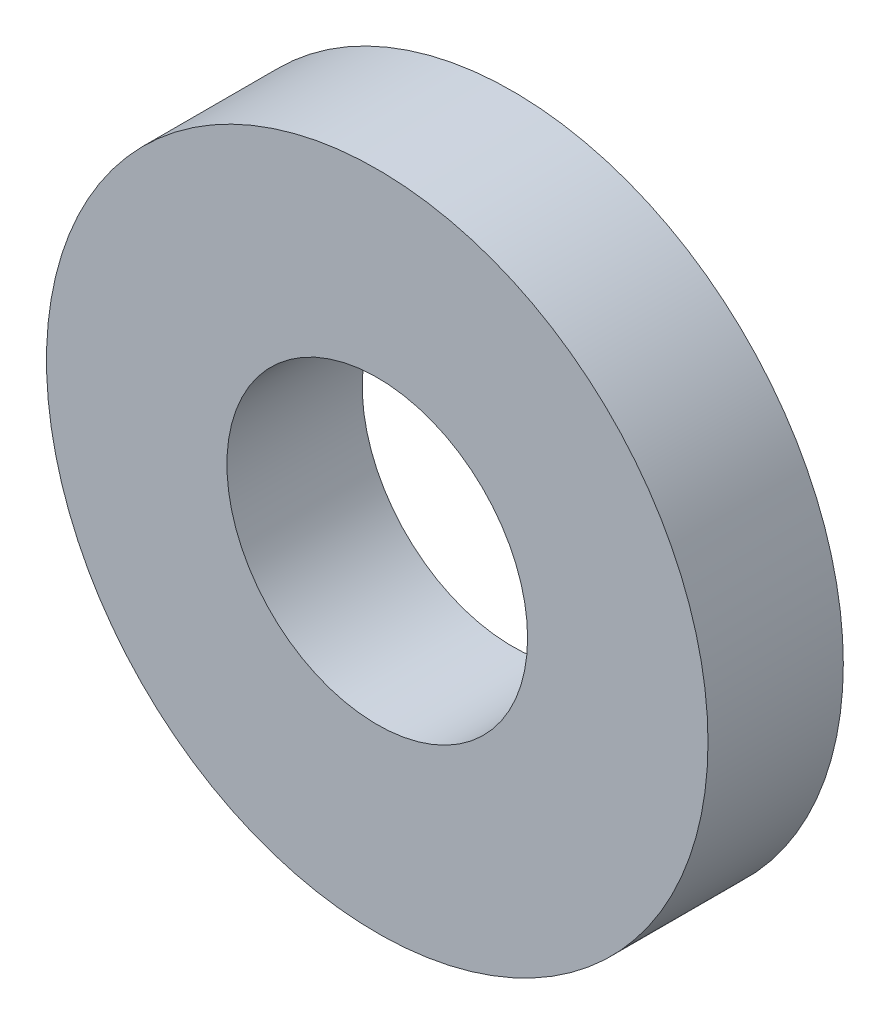
ISO-10303-21;
HEADER;
FILE_DESCRIPTION(('STEP AP214'),'2;1');
FILE_NAME('part.step','',(''),(''),'','','');
FILE_SCHEMA(('AUTOMOTIVE_DESIGN { 1 0 10303 214 1 1 1 1 }'));
ENDSEC;
DATA;
#1=APPLICATION_CONTEXT('core data for automotive mechanical design processes');
#2=APPLICATION_PROTOCOL_DEFINITION('international standard','automotive_design',2000,#1);
#3=PRODUCT_CONTEXT('',#1,'mechanical');
#4=PRODUCT('Part','Part','',(#3));
#5=PRODUCT_RELATED_PRODUCT_CATEGORY('part','',(#4));
#6=PRODUCT_DEFINITION_FORMATION('','',#4);
#7=PRODUCT_DEFINITION_CONTEXT('part definition',#1,'design');
#8=PRODUCT_DEFINITION('design','',#6,#7);
#9=PRODUCT_DEFINITION_SHAPE('','',#8);
#10=(LENGTH_UNIT() NAMED_UNIT(*) SI_UNIT(.MILLI.,.METRE.));
#11=(NAMED_UNIT(*) PLANE_ANGLE_UNIT() SI_UNIT($,.RADIAN.));
#12=(NAMED_UNIT(*) SI_UNIT($,.STERADIAN.) SOLID_ANGLE_UNIT());
#13=UNCERTAINTY_MEASURE_WITH_UNIT(LENGTH_MEASURE(1.E-05),#10,'distance_accuracy_value','');
#14=(GEOMETRIC_REPRESENTATION_CONTEXT(3) GLOBAL_UNCERTAINTY_ASSIGNED_CONTEXT((#13)) GLOBAL_UNIT_ASSIGNED_CONTEXT((#10,
#11,#12)) REPRESENTATION_CONTEXT('',''));
#15=CARTESIAN_POINT('',(0.,0.,0.));
#16=DIRECTION('',(0.,0.,1.));
#17=DIRECTION('',(1.,0.,0.));
#18=AXIS2_PLACEMENT_3D('',#15,#16,#17);
#19=CARTESIAN_POINT('',(0.,0.,-52.9632836658803));
#20=DIRECTION('',(0.,0.,1.));
#21=DIRECTION('',(1.,0.,0.));
#22=AXIS2_PLACEMENT_3D('',#19,#20,#21);
#23=CYLINDRICAL_SURFACE('',#22,7.9375);
#24=CARTESIAN_POINT('',(0.,0.,3.571875));
#25=DIRECTION('',(0.,0.,1.));
#26=DIRECTION('',(1.,0.,0.));
#27=AXIS2_PLACEMENT_3D('',#24,#25,#26);
#28=CIRCLE('',#27,7.9375);
#29=CARTESIAN_POINT('',(7.9375,0.,3.571875));
#30=VERTEX_POINT('',#29);
#31=EDGE_CURVE('E54',#30,#30,#28,.T.);
#32=ORIENTED_EDGE('',*,*,#31,.T.);
#33=EDGE_LOOP('',(#32));
#34=FACE_BOUND('',#33,.T.);
#35=CARTESIAN_POINT('',(0.,0.,-3.571875));
#36=DIRECTION('',(0.,0.,1.));
#37=DIRECTION('',(1.,0.,0.));
#38=AXIS2_PLACEMENT_3D('',#35,#36,#37);
#39=CIRCLE('',#38,7.9375);
#40=CARTESIAN_POINT('',(7.9375,0.,-3.571875));
#41=VERTEX_POINT('',#40);
#42=EDGE_CURVE('E44',#41,#41,#39,.F.);
#43=ORIENTED_EDGE('',*,*,#42,.T.);
#44=EDGE_LOOP('',(#43));
#45=FACE_BOUND('',#44,.T.);
#46=ADVANCED_FACE('F40',(#34,#45),#23,.F.);
#47=CARTESIAN_POINT('',(0.,16.6624,3.571875));
#48=DIRECTION('',(0.,0.,-1.));
#49=DIRECTION('',(-1.,0.,0.));
#50=AXIS2_PLACEMENT_3D('',#47,#48,#49);
#51=PLANE('',#50);
#52=CARTESIAN_POINT('',(0.,0.,3.571875));
#53=DIRECTION('',(0.,0.,1.));
#54=DIRECTION('',(1.,0.,0.));
#55=AXIS2_PLACEMENT_3D('',#52,#53,#54);
#56=CIRCLE('',#55,17.4625);
#57=CARTESIAN_POINT('',(17.4625,0.,3.571875));
#58=VERTEX_POINT('',#57);
#59=EDGE_CURVE('E52',#58,#58,#56,.T.);
#60=ORIENTED_EDGE('',*,*,#59,.T.);
#61=EDGE_LOOP('',(#60));
#62=FACE_BOUND('',#61,.T.);
#63=ORIENTED_EDGE('',*,*,#31,.F.);
#64=EDGE_LOOP('',(#63));
#65=FACE_BOUND('',#64,.T.);
#66=ADVANCED_FACE('F59',(#62,#65),#51,.F.);
#67=CARTESIAN_POINT('',(0.,16.6624,-3.571875));
#68=DIRECTION('',(0.,0.,1.));
#69=DIRECTION('',(1.,0.,0.));
#70=AXIS2_PLACEMENT_3D('',#67,#68,#69);
#71=PLANE('',#70);
#72=CARTESIAN_POINT('',(0.,0.,-3.571875));
#73=DIRECTION('',(0.,0.,1.));
#74=DIRECTION('',(1.,0.,0.));
#75=AXIS2_PLACEMENT_3D('',#72,#73,#74);
#76=CIRCLE('',#75,17.4625);
#77=CARTESIAN_POINT('',(17.4625,0.,-3.571875));
#78=VERTEX_POINT('',#77);
#79=EDGE_CURVE('E12',#78,#78,#76,.F.);
#80=ORIENTED_EDGE('',*,*,#79,.T.);
#81=EDGE_LOOP('',(#80));
#82=FACE_BOUND('',#81,.T.);
#83=ORIENTED_EDGE('',*,*,#42,.F.);
#84=EDGE_LOOP('',(#83));
#85=FACE_BOUND('',#84,.T.);
#86=ADVANCED_FACE('F64',(#82,#85),#71,.F.);
#87=CARTESIAN_POINT('',(0.,0.,3.571875));
#88=DIRECTION('',(0.,0.,1.));
#89=DIRECTION('',(1.,0.,0.));
#90=AXIS2_PLACEMENT_3D('',#87,#88,#89);
#91=CYLINDRICAL_SURFACE('',#90,17.4625);
#92=ORIENTED_EDGE('',*,*,#59,.F.);
#93=EDGE_LOOP('',(#92));
#94=FACE_BOUND('',#93,.T.);
#95=ORIENTED_EDGE('',*,*,#79,.F.);
#96=EDGE_LOOP('',(#95));
#97=FACE_BOUND('',#96,.T.);
#98=ADVANCED_FACE('F42',(#94,#97),#91,.T.);
#99=CLOSED_SHELL('',(#46,#66,#86,#98));
#100=MANIFOLD_SOLID_BREP('B2',#99);
#101=ADVANCED_BREP_SHAPE_REPRESENTATION('',(#18,#100),#14);
#102=SHAPE_DEFINITION_REPRESENTATION(#9,#101);
ENDSEC;
END-ISO-10303-21;
